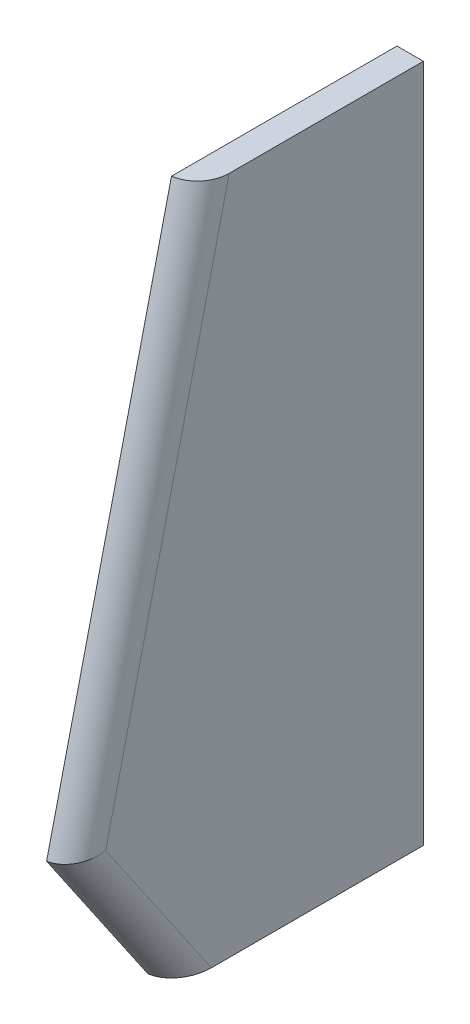
ISO-10303-21;
HEADER;
FILE_DESCRIPTION(('STEP AP214'),'2;1');
FILE_NAME('part.step','',(''),(''),'','','');
FILE_SCHEMA(('AUTOMOTIVE_DESIGN { 1 0 10303 214 1 1 1 1 }'));
ENDSEC;
DATA;
#1=APPLICATION_CONTEXT('core data for automotive mechanical design processes');
#2=APPLICATION_PROTOCOL_DEFINITION('international standard','automotive_design',2000,#1);
#3=PRODUCT_CONTEXT('',#1,'mechanical');
#4=PRODUCT('Part','Part','',(#3));
#5=PRODUCT_RELATED_PRODUCT_CATEGORY('part','',(#4));
#6=PRODUCT_DEFINITION_FORMATION('','',#4);
#7=PRODUCT_DEFINITION_CONTEXT('part definition',#1,'design');
#8=PRODUCT_DEFINITION('design','',#6,#7);
#9=PRODUCT_DEFINITION_SHAPE('','',#8);
#10=(LENGTH_UNIT() NAMED_UNIT(*) SI_UNIT(.MILLI.,.METRE.));
#11=(NAMED_UNIT(*) PLANE_ANGLE_UNIT() SI_UNIT($,.RADIAN.));
#12=(NAMED_UNIT(*) SI_UNIT($,.STERADIAN.) SOLID_ANGLE_UNIT());
#13=UNCERTAINTY_MEASURE_WITH_UNIT(LENGTH_MEASURE(1.E-05),#10,'distance_accuracy_value','');
#14=(GEOMETRIC_REPRESENTATION_CONTEXT(3) GLOBAL_UNCERTAINTY_ASSIGNED_CONTEXT((#13)) GLOBAL_UNIT_ASSIGNED_CONTEXT((#10,
#11,#12)) REPRESENTATION_CONTEXT('',''));
#15=CARTESIAN_POINT('',(0.,0.,0.));
#16=DIRECTION('',(0.,0.,1.));
#17=DIRECTION('',(1.,0.,0.));
#18=AXIS2_PLACEMENT_3D('',#15,#16,#17);
#19=CARTESIAN_POINT('',(8.6,-75.9087273516426,0.));
#20=DIRECTION('',(0.,-1.,0.));
#21=DIRECTION('',(0.,0.,-1.));
#22=AXIS2_PLACEMENT_3D('',#19,#20,#21);
#23=PLANE('',#22);
#24=DIRECTION('',(0.,0.,1.));
#25=VECTOR('',#24,1.);
#26=CARTESIAN_POINT('',(8.6,-75.9087273516426,0.));
#27=LINE('',#26,#25);
#28=CARTESIAN_POINT('',(8.6,-75.9087273516426,-93.5922306887143));
#29=VERTEX_POINT('',#28);
#30=CARTESIAN_POINT('',(8.6,-75.9087273516426,-24.5831283763899));
#31=VERTEX_POINT('',#30);
#32=EDGE_CURVE('E93',#29,#31,#27,.T.);
#33=ORIENTED_EDGE('',*,*,#32,.T.);
#34=CARTESIAN_POINT('',(-1.4,-75.9087273516426,-24.5831283763899));
#35=DIRECTION('',(0.,-1.,0.));
#36=DIRECTION('',(0.,0.,1.));
#37=AXIS2_PLACEMENT_3D('',#34,#35,#36);
#38=ELLIPSE('',#37,12.1150384715847,10.);
#39=CARTESIAN_POINT('',(0.,-75.9087273516426,-12.5874048180761));
#40=VERTEX_POINT('',#39);
#41=EDGE_CURVE('E47',#31,#40,#38,.T.);
#42=ORIENTED_EDGE('',*,*,#41,.T.);
#43=DIRECTION('',(0.,0.,1.));
#44=VECTOR('',#43,1.);
#45=CARTESIAN_POINT('',(0.,-75.9087273516426,0.));
#46=LINE('',#45,#44);
#47=CARTESIAN_POINT('',(0.,-75.9087273516426,-93.5922306887143));
#48=VERTEX_POINT('',#47);
#49=EDGE_CURVE('E96',#48,#40,#46,.T.);
#50=ORIENTED_EDGE('',*,*,#49,.F.);
#51=DIRECTION('',(-1.,0.,0.));
#52=VECTOR('',#51,1.);
#53=CARTESIAN_POINT('',(8.6,-75.9087273516426,-93.5922306887143));
#54=LINE('',#53,#52);
#55=EDGE_CURVE('E91',#29,#48,#54,.T.);
#56=ORIENTED_EDGE('',*,*,#55,.F.);
#57=EDGE_LOOP('',(#33,#42,#50,#56));
#58=FACE_BOUND('',#57,.T.);
#59=ADVANCED_FACE('F38',(#58),#23,.T.);
#60=CARTESIAN_POINT('',(8.6,0.0206091949788334,-93.5755079101106));
#61=DIRECTION('',(0.,0.000220241331725321,-0.999999975746877));
#62=DIRECTION('',(0.,0.999999975746878,0.000220241331725321));
#63=AXIS2_PLACEMENT_3D('',#60,#61,#62);
#64=PLANE('',#63);
#65=DIRECTION('',(0.,-0.999999975746878,-0.000220241331725321));
#66=VECTOR('',#65,1.);
#67=CARTESIAN_POINT('',(0.,0.0206091949788334,-93.5755079101106));
#68=LINE('',#67,#66);
#69=CARTESIAN_POINT('',(0.,-27.6487273516426,-93.5816018417874));
#70=VERTEX_POINT('',#69);
#71=EDGE_CURVE('E125',#70,#48,#68,.T.);
#72=ORIENTED_EDGE('',*,*,#71,.F.);
#73=DIRECTION('',(-1.,0.,0.));
#74=VECTOR('',#73,1.);
#75=CARTESIAN_POINT('',(8.6,-27.6487273516426,-93.5816018417874));
#76=LINE('',#75,#74);
#77=CARTESIAN_POINT('',(8.6,-27.6487273516426,-93.5816018417874));
#78=VERTEX_POINT('',#77);
#79=EDGE_CURVE('E101',#78,#70,#76,.T.);
#80=ORIENTED_EDGE('',*,*,#79,.F.);
#81=DIRECTION('',(0.,-0.999999975746878,-0.000220241331725321));
#82=VECTOR('',#81,1.);
#83=CARTESIAN_POINT('',(8.6,0.0206091949788334,-93.5755079101106));
#84=LINE('',#83,#82);
#85=EDGE_CURVE('E106',#78,#29,#84,.T.);
#86=ORIENTED_EDGE('',*,*,#85,.T.);
#87=ORIENTED_EDGE('',*,*,#55,.T.);
#88=EDGE_LOOP('',(#72,#80,#86,#87));
#89=FACE_BOUND('',#88,.T.);
#90=ADVANCED_FACE('F110',(#89),#64,.T.);
#91=CARTESIAN_POINT('',(8.6,-0.00575893122862755,-93.5833029353489));
#92=DIRECTION('',(0.,6.15380205345148E-05,0.999999998106536));
#93=DIRECTION('',(0.,-0.999999998106536,6.15380205345148E-05));
#94=AXIS2_PLACEMENT_3D('',#91,#92,#93);
#95=PLANE('',#94);
#96=DIRECTION('',(0.,0.999999998106536,-6.15380205345148E-05));
#97=VECTOR('',#96,1.);
#98=CARTESIAN_POINT('',(0.,-0.00575893122862755,-93.5833029353489));
#99=LINE('',#98,#97);
#100=CARTESIAN_POINT('',(0.,145.071272648357,-93.5922306887143));
#101=VERTEX_POINT('',#100);
#102=EDGE_CURVE('E127',#70,#101,#99,.T.);
#103=ORIENTED_EDGE('',*,*,#102,.T.);
#104=DIRECTION('',(-1.,0.,0.));
#105=VECTOR('',#104,1.);
#106=CARTESIAN_POINT('',(8.6,145.071272648357,-93.5922306887143));
#107=LINE('',#106,#105);
#108=CARTESIAN_POINT('',(8.6,145.071272648357,-93.5922306887143));
#109=VERTEX_POINT('',#108);
#110=EDGE_CURVE('E118',#109,#101,#107,.T.);
#111=ORIENTED_EDGE('',*,*,#110,.F.);
#112=DIRECTION('',(0.,0.999999998106536,-6.15380205345148E-05));
#113=VECTOR('',#112,1.);
#114=CARTESIAN_POINT('',(8.6,-0.00575893122862755,-93.5833029353489));
#115=LINE('',#114,#113);
#116=EDGE_CURVE('E112',#78,#109,#115,.T.);
#117=ORIENTED_EDGE('',*,*,#116,.F.);
#118=ORIENTED_EDGE('',*,*,#79,.T.);
#119=EDGE_LOOP('',(#103,#111,#117,#118));
#120=FACE_BOUND('',#119,.T.);
#121=ADVANCED_FACE('F148',(#120),#95,.F.);
#122=CARTESIAN_POINT('',(8.6,145.071272648357,0.));
#123=DIRECTION('',(0.,1.,0.));
#124=DIRECTION('',(0.,0.,1.));
#125=AXIS2_PLACEMENT_3D('',#122,#123,#124);
#126=PLANE('',#125);
#127=DIRECTION('',(0.,0.,-1.));
#128=VECTOR('',#127,1.);
#129=CARTESIAN_POINT('',(0.,145.071272648357,0.));
#130=LINE('',#129,#128);
#131=CARTESIAN_POINT('',(0.,145.071272648357,-20.221601871842));
#132=VERTEX_POINT('',#131);
#133=EDGE_CURVE('E108',#132,#101,#130,.T.);
#134=ORIENTED_EDGE('',*,*,#133,.F.);
#135=CARTESIAN_POINT('',(-1.4,145.071272648357,-30.393515166657));
#136=DIRECTION('',(0.,1.,0.));
#137=DIRECTION('',(0.,0.,-1.));
#138=AXIS2_PLACEMENT_3D('',#135,#136,#137);
#139=ELLIPSE('',#138,10.2730877630885,10.);
#140=CARTESIAN_POINT('',(8.6,145.071272648357,-30.393515166657));
#141=VERTEX_POINT('',#140);
#142=EDGE_CURVE('E11',#132,#141,#139,.T.);
#143=ORIENTED_EDGE('',*,*,#142,.T.);
#144=DIRECTION('',(0.,0.,-1.));
#145=VECTOR('',#144,1.);
#146=CARTESIAN_POINT('',(8.6,145.071272648357,0.));
#147=LINE('',#146,#145);
#148=EDGE_CURVE('E114',#141,#109,#147,.T.);
#149=ORIENTED_EDGE('',*,*,#148,.T.);
#150=ORIENTED_EDGE('',*,*,#110,.T.);
#151=EDGE_LOOP('',(#134,#143,#149,#150));
#152=FACE_BOUND('',#151,.T.);
#153=ADVANCED_FACE('F145',(#152),#126,.T.);
#154=CARTESIAN_POINT('',(8.6,0.,0.));
#155=DIRECTION('',(1.,0.,0.));
#156=DIRECTION('',(0.,0.,-1.));
#157=AXIS2_PLACEMENT_3D('',#154,#155,#156);
#158=PLANE('',#157);
#159=DIRECTION('',(0.,-0.973417168295812,0.229039333886043));
#160=VECTOR('',#159,1.);
#161=CARTESIAN_POINT('',(8.6,-29.9165637598566,10.7800934304306));
#162=LINE('',#161,#160);
#163=CARTESIAN_POINT('',(8.6,-25.6646221543925,9.77963658134626));
#164=VERTEX_POINT('',#163);
#165=EDGE_CURVE('E54',#141,#164,#162,.T.);
#166=ORIENTED_EDGE('',*,*,#165,.T.);
#167=DIRECTION('',(0.,-0.825420408152609,-0.564518511481404));
#168=VECTOR('',#167,1.);
#169=CARTESIAN_POINT('',(8.6,-70.319138822341,-20.7603174000814));
#170=LINE('',#169,#168);
#171=EDGE_CURVE('E107',#164,#31,#170,.T.);
#172=ORIENTED_EDGE('',*,*,#171,.T.);
#173=ORIENTED_EDGE('',*,*,#32,.F.);
#174=ORIENTED_EDGE('',*,*,#85,.F.);
#175=ORIENTED_EDGE('',*,*,#116,.T.);
#176=ORIENTED_EDGE('',*,*,#148,.F.);
#177=EDGE_LOOP('',(#166,#172,#173,#174,#175,#176));
#178=FACE_BOUND('',#177,.T.);
#179=ADVANCED_FACE('F104',(#178),#158,.T.);
#180=CARTESIAN_POINT('',(0.,0.,0.));
#181=DIRECTION('',(1.,0.,0.));
#182=DIRECTION('',(0.,0.,-1.));
#183=AXIS2_PLACEMENT_3D('',#180,#181,#182);
#184=PLANE('',#183);
#185=DIRECTION('',(0.,0.973417168295812,-0.229039333886043));
#186=VECTOR('',#185,1.);
#187=CARTESIAN_POINT('',(0.,3.10187356534834,13.1829626429813));
#188=LINE('',#187,#186);
#189=CARTESIAN_POINT('',(0.,-27.6487273516426,20.4183981582123));
#190=VERTEX_POINT('',#189);
#191=EDGE_CURVE('E119',#190,#132,#188,.T.);
#192=ORIENTED_EDGE('',*,*,#191,.T.);
#193=ORIENTED_EDGE('',*,*,#133,.T.);
#194=ORIENTED_EDGE('',*,*,#102,.F.);
#195=ORIENTED_EDGE('',*,*,#71,.T.);
#196=ORIENTED_EDGE('',*,*,#49,.T.);
#197=DIRECTION('',(0.,0.825420408152609,0.564518511481404));
#198=VECTOR('',#197,1.);
#199=CARTESIAN_POINT('',(0.,-18.3253891659019,26.7947815655863));
#200=LINE('',#199,#198);
#201=EDGE_CURVE('E121',#40,#190,#200,.T.);
#202=ORIENTED_EDGE('',*,*,#201,.T.);
#203=EDGE_LOOP('',(#192,#193,#194,#195,#196,#202));
#204=FACE_BOUND('',#203,.T.);
#205=ADVANCED_FACE('F139',(#204),#184,.F.);
#206=CARTESIAN_POINT('',(-1.4,0.834037157134346,3.5446579151996));
#207=DIRECTION('',(0.,0.973417168295812,-0.229039333886043));
#208=DIRECTION('',(0.,0.229039333886043,0.973417168295812));
#209=AXIS2_PLACEMENT_3D('',#206,#207,#208);
#210=CYLINDRICAL_SURFACE('',#209,10.);
#211=ORIENTED_EDGE('',*,*,#142,.F.);
#212=ORIENTED_EDGE('',*,*,#191,.F.);
#213=CARTESIAN_POINT('',(-1.4,-25.6646221543925,9.77963658134626));
#214=DIRECTION('',(0.,0.983050186967463,0.183336657281724));
#215=DIRECTION('',(0.,0.183336657281724,-0.983050186967463));
#216=AXIS2_PLACEMENT_3D('',#213,#214,#215);
#217=ELLIPSE('',#216,10.9298382448556,10.);
#218=EDGE_CURVE('E42',#164,#190,#217,.F.);
#219=ORIENTED_EDGE('',*,*,#218,.F.);
#220=ORIENTED_EDGE('',*,*,#165,.F.);
#221=EDGE_LOOP('',(#211,#212,#219,#220));
#222=FACE_BOUND('',#221,.T.);
#223=ADVANCED_FACE('F40',(#222),#210,.T.);
#224=CARTESIAN_POINT('',(-1.4,-12.7358006366003,18.621868983581));
#225=DIRECTION('',(0.,0.825420408152609,0.564518511481404));
#226=DIRECTION('',(0.,-0.564518511481404,0.825420408152609));
#227=AXIS2_PLACEMENT_3D('',#224,#225,#226);
#228=CYLINDRICAL_SURFACE('',#227,10.);
#229=ORIENTED_EDGE('',*,*,#41,.F.);
#230=ORIENTED_EDGE('',*,*,#171,.F.);
#231=ORIENTED_EDGE('',*,*,#218,.T.);
#232=ORIENTED_EDGE('',*,*,#201,.F.);
#233=EDGE_LOOP('',(#229,#230,#231,#232));
#234=FACE_BOUND('',#233,.T.);
#235=ADVANCED_FACE('F141',(#234),#228,.T.);
#236=CLOSED_SHELL('',(#59,#90,#121,#153,#179,#205,#223,#235));
#237=MANIFOLD_SOLID_BREP('B2',#236);
#238=ADVANCED_BREP_SHAPE_REPRESENTATION('',(#18,#237),#14);
#239=SHAPE_DEFINITION_REPRESENTATION(#9,#238);
ENDSEC;
END-ISO-10303-21;
